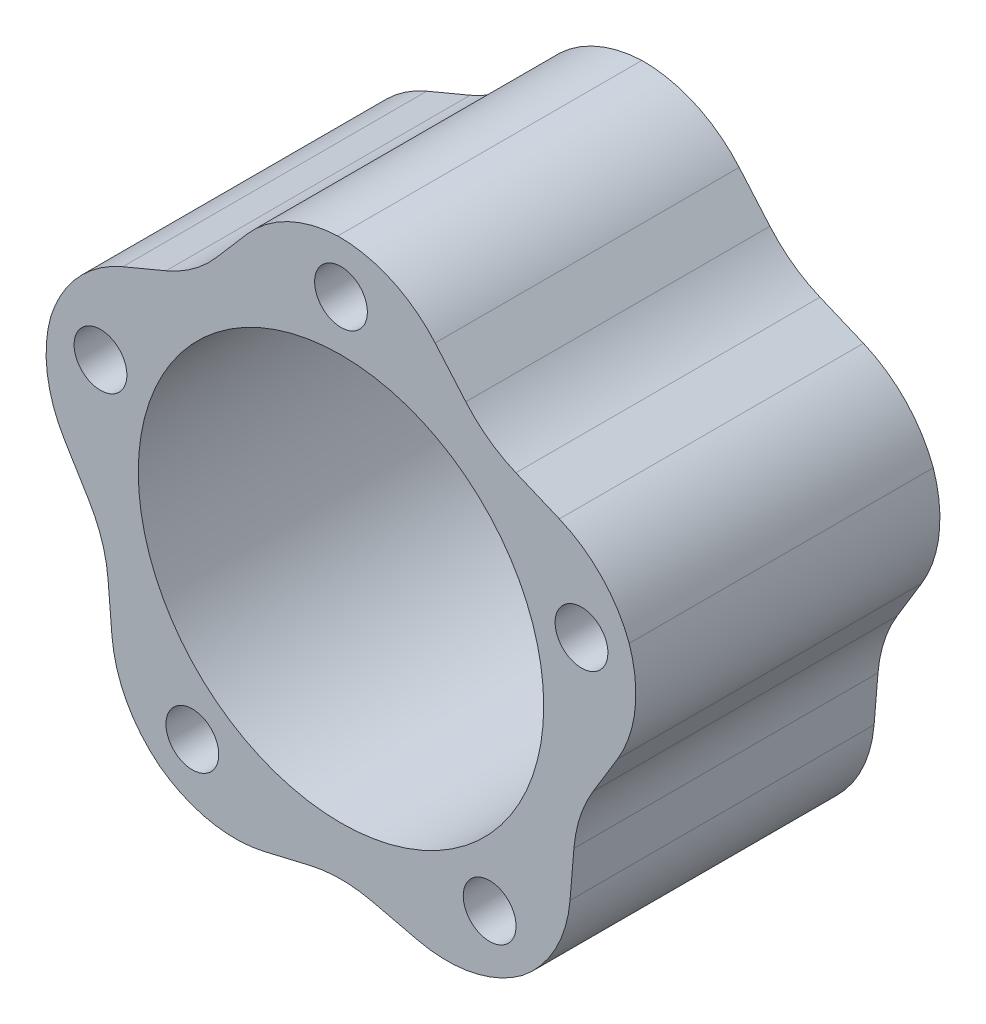
ISO-10303-21;
HEADER;
FILE_DESCRIPTION(('STEP AP214'),'2;1');
FILE_NAME('part.step','',(''),(''),'','','');
FILE_SCHEMA(('AUTOMOTIVE_DESIGN { 1 0 10303 214 1 1 1 1 }'));
ENDSEC;
DATA;
#1=APPLICATION_CONTEXT('core data for automotive mechanical design processes');
#2=APPLICATION_PROTOCOL_DEFINITION('international standard','automotive_design',2000,#1);
#3=PRODUCT_CONTEXT('',#1,'mechanical');
#4=PRODUCT('Part','Part','',(#3));
#5=PRODUCT_RELATED_PRODUCT_CATEGORY('part','',(#4));
#6=PRODUCT_DEFINITION_FORMATION('','',#4);
#7=PRODUCT_DEFINITION_CONTEXT('part definition',#1,'design');
#8=PRODUCT_DEFINITION('design','',#6,#7);
#9=PRODUCT_DEFINITION_SHAPE('','',#8);
#10=(LENGTH_UNIT() NAMED_UNIT(*) SI_UNIT(.MILLI.,.METRE.));
#11=(NAMED_UNIT(*) PLANE_ANGLE_UNIT() SI_UNIT($,.RADIAN.));
#12=(NAMED_UNIT(*) SI_UNIT($,.STERADIAN.) SOLID_ANGLE_UNIT());
#13=UNCERTAINTY_MEASURE_WITH_UNIT(LENGTH_MEASURE(1.E-05),#10,'distance_accuracy_value','');
#14=(GEOMETRIC_REPRESENTATION_CONTEXT(3) GLOBAL_UNCERTAINTY_ASSIGNED_CONTEXT((#13)) GLOBAL_UNIT_ASSIGNED_CONTEXT((#10,
#11,#12)) REPRESENTATION_CONTEXT('',''));
#15=CARTESIAN_POINT('',(0.,0.,0.));
#16=DIRECTION('',(0.,0.,1.));
#17=DIRECTION('',(1.,0.,0.));
#18=AXIS2_PLACEMENT_3D('',#15,#16,#17);
#19=CARTESIAN_POINT('',(0.,0.,28.575));
#20=DIRECTION('',(0.,0.,1.));
#21=DIRECTION('',(1.,0.,0.));
#22=AXIS2_PLACEMENT_3D('',#19,#20,#21);
#23=PLANE('',#22);
#24=DIRECTION('',(-0.0828522318108421,0.996561843381515,0.));
#25=VECTOR('',#24,1.);
#26=CARTESIAN_POINT('',(-44.2708771620068,-14.3844799594441,28.575));
#27=LINE('',#26,#25);
#28=CARTESIAN_POINT('',(-43.0416276018826,-29.1701191732451,28.575));
#29=VERTEX_POINT('',#28);
#30=CARTESIAN_POINT('',(-43.7754438644512,-20.3436425491958,28.575));
#31=VERTEX_POINT('',#30);
#32=EDGE_CURVE('E426',#29,#31,#27,.T.);
#33=ORIENTED_EDGE('',*,*,#32,.F.);
#34=CARTESIAN_POINT('',(-19.3109987063603,-27.1972004032494,28.575));
#35=DIRECTION('',(0.,0.,1.));
#36=DIRECTION('',(1.,0.,0.));
#37=AXIS2_PLACEMENT_3D('',#34,#35,#36);
#38=CIRCLE('',#37,23.8125);
#39=CARTESIAN_POINT('',(-34.0722514510411,-45.8825040844223,28.575));
#40=VERTEX_POINT('',#39);
#41=EDGE_CURVE('E363',#29,#40,#38,.T.);
#42=ORIENTED_EDGE('',*,*,#41,.T.);
#43=CARTESIAN_POINT('',(-19.8754800131073,-26.7647940492464,28.575));
#44=DIRECTION('',(0.,0.,1.));
#45=DIRECTION('',(1.,0.,0.));
#46=AXIS2_PLACEMENT_3D('',#43,#44,#45);
#47=CIRCLE('',#46,23.8125);
#48=CARTESIAN_POINT('',(-14.4186696495109,-49.9436287245648,28.575));
#49=VERTEX_POINT('',#48);
#50=EDGE_CURVE('E259',#40,#49,#47,.T.);
#51=ORIENTED_EDGE('',*,*,#50,.T.);
#52=DIRECTION('',(-0.97338938269054,-0.229157390597226,0.));
#53=VECTOR('',#52,1.);
#54=CARTESIAN_POINT('',(-88.8599387502561,-67.46875,28.575));
#55=LINE('',#54,#53);
#56=CARTESIAN_POINT('',(-5.82059772116957,-47.9194524161898,28.575));
#57=VERTEX_POINT('',#56);
#58=EDGE_CURVE('E470',#57,#49,#55,.T.);
#59=ORIENTED_EDGE('',*,*,#58,.F.);
#60=CARTESIAN_POINT('',(0.,-72.6435427365296,28.575));
#61=DIRECTION('',(0.,0.,1.));
#62=DIRECTION('',(1.,0.,0.));
#63=AXIS2_PLACEMENT_3D('',#60,#61,#62);
#64=CIRCLE('',#63,25.4);
#65=CARTESIAN_POINT('',(5.82059772116952,-47.9194524161898,28.575));
#66=VERTEX_POINT('',#65);
#67=EDGE_CURVE('E277',#57,#66,#64,.F.);
#68=ORIENTED_EDGE('',*,*,#67,.T.);
#69=DIRECTION('',(-0.97338938269054,0.229157390597226,0.));
#70=VECTOR('',#69,1.);
#71=CARTESIAN_POINT('',(0.,-46.549154969743,28.575));
#72=LINE('',#71,#70);
#73=CARTESIAN_POINT('',(14.4186696495108,-49.9436287245648,28.575));
#74=VERTEX_POINT('',#73);
#75=EDGE_CURVE('E480',#74,#66,#72,.T.);
#76=ORIENTED_EDGE('',*,*,#75,.F.);
#77=CARTESIAN_POINT('',(19.8754800131073,-26.7647940492464,28.575));
#78=DIRECTION('',(0.,0.,1.));
#79=DIRECTION('',(1.,0.,0.));
#80=AXIS2_PLACEMENT_3D('',#77,#78,#79);
#81=CIRCLE('',#80,23.8125);
#82=CARTESIAN_POINT('',(34.072251451041,-45.8825040844223,28.575));
#83=VERTEX_POINT('',#82);
#84=EDGE_CURVE('E263',#74,#83,#81,.T.);
#85=ORIENTED_EDGE('',*,*,#84,.T.);
#86=CARTESIAN_POINT('',(19.3109987063607,-27.1972004032491,28.575));
#87=DIRECTION('',(0.,0.,1.));
#88=DIRECTION('',(1.,0.,0.));
#89=AXIS2_PLACEMENT_3D('',#86,#87,#88);
#90=CIRCLE('',#89,23.8125);
#91=CARTESIAN_POINT('',(43.041627601883,-29.1701191732444,28.575));
#92=VERTEX_POINT('',#91);
#93=EDGE_CURVE('E244',#83,#92,#90,.T.);
#94=ORIENTED_EDGE('',*,*,#93,.T.);
#95=DIRECTION('',(-0.0828522318108279,-0.996561843381516,0.));
#96=VECTOR('',#95,1.);
#97=CARTESIAN_POINT('',(36.7073631408429,-105.359814125254,28.575));
#98=LINE('',#97,#96);
#99=CARTESIAN_POINT('',(43.7754438644515,-20.3436425491951,28.575));
#100=VERTEX_POINT('',#99);
#101=EDGE_CURVE('E457',#100,#92,#98,.T.);
#102=ORIENTED_EDGE('',*,*,#101,.F.);
#103=CARTESIAN_POINT('',(69.088114686342,-22.4480892371902,28.575));
#104=DIRECTION('',(0.,0.,1.));
#105=DIRECTION('',(1.,0.,0.));
#106=AXIS2_PLACEMENT_3D('',#103,#104,#105);
#107=CIRCLE('',#106,25.4);
#108=CARTESIAN_POINT('',(47.3727710909744,-9.27220776629314,28.575));
#109=VERTEX_POINT('',#108);
#110=EDGE_CURVE('E377',#100,#109,#107,.F.);
#111=ORIENTED_EDGE('',*,*,#110,.T.);
#112=DIRECTION('',(-0.518735490980199,-0.854934787219196,0.));
#113=VECTOR('',#112,1.);
#114=CARTESIAN_POINT('',(44.270877162007,-14.3844799594435,28.575));
#115=LINE('',#114,#113);
#116=CARTESIAN_POINT('',(51.9548275039003,-1.72046031016872,28.575));
#117=VERTEX_POINT('',#116);
#118=EDGE_CURVE('E466',#117,#109,#115,.T.);
#119=ORIENTED_EDGE('',*,*,#118,.F.);
#120=CARTESIAN_POINT('',(31.5966928832432,10.6319285687973,28.575));
#121=DIRECTION('',(0.,0.,1.));
#122=DIRECTION('',(1.,0.,0.));
#123=AXIS2_PLACEMENT_3D('',#120,#121,#122);
#124=CIRCLE('',#123,23.8125);
#125=CARTESIAN_POINT('',(54.1657592284169,18.2261632607953,28.575));
#126=VERTEX_POINT('',#125);
#127=EDGE_CURVE('E293',#117,#126,#124,.T.);
#128=ORIENTED_EDGE('',*,*,#127,.T.);
#129=CARTESIAN_POINT('',(31.8335014471133,9.96145403182651,28.575));
#130=DIRECTION('',(0.,0.,1.));
#131=DIRECTION('',(1.,0.,0.));
#132=AXIS2_PLACEMENT_3D('',#129,#130,#131);
#133=CIRCLE('',#132,23.8125);
#134=CARTESIAN_POINT('',(41.0430263153599,31.9209578502452,28.575));
#135=VERTEX_POINT('',#134);
#136=EDGE_CURVE('E313',#126,#135,#133,.T.);
#137=ORIENTED_EDGE('',*,*,#136,.T.);
#138=DIRECTION('',(0.922183887387664,-0.386751700503795,0.));
#139=VECTOR('',#138,1.);
#140=CARTESIAN_POINT('',(111.546336808682,2.35280382222236,28.575));
#141=LINE('',#140,#139);
#142=CARTESIAN_POINT('',(32.8753099020134,35.3463898658088,28.575));
#143=VERTEX_POINT('',#142);
#144=EDGE_CURVE('E442',#143,#135,#141,.T.);
#145=ORIENTED_EDGE('',*,*,#144,.F.);
#146=CARTESIAN_POINT('',(42.6988030948098,58.7698606054554,28.575));
#147=DIRECTION('',(0.,0.,1.));
#148=DIRECTION('',(1.,0.,0.));
#149=AXIS2_PLACEMENT_3D('',#146,#147,#148);
#150=CIRCLE('',#149,25.4);
#151=CARTESIAN_POINT('',(23.4573849543208,42.18891286587,28.575));
#152=VERTEX_POINT('',#151);
#153=EDGE_CURVE('E390',#143,#152,#150,.F.);
#154=ORIENTED_EDGE('',*,*,#153,.T.);
#155=DIRECTION('',(0.652793218093915,-0.757536147263344,0.));
#156=VECTOR('',#155,1.);
#157=CARTESIAN_POINT('',(27.3609067978916,37.6590574443152,28.575));
#158=LINE('',#157,#156);
#159=CARTESIAN_POINT('',(17.6911796275371,48.8803257765854,28.575));
#160=VERTEX_POINT('',#159);
#161=EDGE_CURVE('E453',#160,#152,#158,.T.);
#162=ORIENTED_EDGE('',*,*,#161,.F.);
#163=CARTESIAN_POINT('',(-0.347649879171224,33.335687270724,28.575));
#164=DIRECTION('',(0.,0.,1.));
#165=DIRECTION('',(1.,0.,0.));
#166=AXIS2_PLACEMENT_3D('',#163,#164,#165);
#167=CIRCLE('',#166,23.8125);
#168=CARTESIAN_POINT('',(-0.595971221436384,57.1468924640983,28.575));
#169=VERTEX_POINT('',#168);
#170=EDGE_CURVE('E317',#160,#169,#167,.T.);
#171=ORIENTED_EDGE('',*,*,#170,.T.);
#172=CARTESIAN_POINT('',(0.363187168874133,33.3537175722875,28.575));
#173=DIRECTION('',(0.,0.,1.));
#174=DIRECTION('',(1.,0.,0.));
#175=AXIS2_PLACEMENT_3D('',#172,#173,#174);
#176=CIRCLE('',#175,23.8125);
#177=CARTESIAN_POINT('',(-17.6756423378344,48.8983560781486,28.575));
#178=VERTEX_POINT('',#177);
#179=EDGE_CURVE('E338',#169,#178,#176,.T.);
#180=ORIENTED_EDGE('',*,*,#179,.T.);
#181=DIRECTION('',(0.652793218093904,0.757536147263353,0.));
#182=VECTOR('',#181,1.);
#183=CARTESIAN_POINT('',(32.2320643274654,106.813926856248,28.575));
#184=LINE('',#183,#182);
#185=CARTESIAN_POINT('',(-23.4573849543215,42.1889128658696,28.575));
#186=VERTEX_POINT('',#185);
#187=EDGE_CURVE('E443',#186,#178,#184,.T.);
#188=ORIENTED_EDGE('',*,*,#187,.F.);
#189=CARTESIAN_POINT('',(-42.6988030948106,58.7698606054548,28.575));
#190=DIRECTION('',(0.,0.,1.));
#191=DIRECTION('',(1.,0.,0.));
#192=AXIS2_PLACEMENT_3D('',#189,#190,#191);
#193=CIRCLE('',#192,25.4);
#194=CARTESIAN_POINT('',(-32.8753099020139,35.3463898658083,28.575));
#195=VERTEX_POINT('',#194);
#196=EDGE_CURVE('E403',#186,#195,#193,.F.);
#197=ORIENTED_EDGE('',*,*,#196,.T.);
#198=DIRECTION('',(0.922183887387658,0.386751700503808,0.));
#199=VECTOR('',#198,1.);
#200=CARTESIAN_POINT('',(-27.3609067978921,37.6590574443149,28.575));
#201=LINE('',#200,#199);
#202=CARTESIAN_POINT('',(-41.0210771930028,31.9301630212658,28.575));
#203=VERTEX_POINT('',#202);
#204=EDGE_CURVE('E438',#203,#195,#201,.T.);
#205=ORIENTED_EDGE('',*,*,#204,.F.);
#206=CARTESIAN_POINT('',(-31.8115523247558,9.97065920284721,28.575));
#207=DIRECTION('',(0.,0.,1.));
#208=DIRECTION('',(1.,0.,0.));
#209=AXIS2_PLACEMENT_3D('',#206,#207,#208);
#210=CIRCLE('',#209,23.8125);
#211=CARTESIAN_POINT('',(-54.5340896995814,17.0925586334524,28.575));
#212=VERTEX_POINT('',#211);
#213=EDGE_CURVE('E342',#203,#212,#210,.T.);
#214=ORIENTED_EDGE('',*,*,#213,.T.);
#215=CARTESIAN_POINT('',(-31.6090394324712,10.6522770790117,28.575));
#216=DIRECTION('',(0.,0.,1.));
#217=DIRECTION('',(1.,0.,0.));
#218=AXIS2_PLACEMENT_3D('',#215,#216,#217);
#219=CIRCLE('',#218,23.8125);
#220=CARTESIAN_POINT('',(-51.9671740531282,-1.70011179995462,28.575));
#221=VERTEX_POINT('',#220);
#222=EDGE_CURVE('E359',#212,#221,#219,.T.);
#223=ORIENTED_EDGE('',*,*,#222,.T.);
#224=DIRECTION('',(-0.518735490980211,0.854934787219188,0.));
#225=VECTOR('',#224,1.);
#226=CARTESIAN_POINT('',(-91.6258255267355,63.6618334467836,28.575));
#227=LINE('',#226,#225);
#228=CARTESIAN_POINT('',(-47.3727710909743,-9.27220776629378,28.575));
#229=VERTEX_POINT('',#228);
#230=EDGE_CURVE('E419',#229,#221,#227,.T.);
#231=ORIENTED_EDGE('',*,*,#230,.F.);
#232=CARTESIAN_POINT('',(-69.0881146863417,-22.4480892371912,28.575));
#233=DIRECTION('',(0.,0.,1.));
#234=DIRECTION('',(1.,0.,0.));
#235=AXIS2_PLACEMENT_3D('',#232,#233,#234);
#236=CIRCLE('',#235,25.4);
#237=EDGE_CURVE('E56',#229,#31,#236,.F.);
#238=ORIENTED_EDGE('',*,*,#237,.T.);
#239=EDGE_LOOP('',(#33,#42,#51,#59,#68,#76,#85,#94,#102,#111,#119,#128,#137,#145,#154,#162,#171,
#180,#188,#197,#205,#214,#223,#231,#238));
#240=FACE_BOUND('',#239,.T.);
#241=CARTESIAN_POINT('',(45.1974392465012,14.6855382304783,28.575));
#242=DIRECTION('',(0.,0.,1.));
#243=DIRECTION('',(0.309016994374945,-0.951056516295155,0.));
#244=AXIS2_PLACEMENT_3D('',#241,#242,#243);
#245=CIRCLE('',#244,4.96093749999999);
#246=CARTESIAN_POINT('',(46.7304532420331,9.96740629417026,28.575));
#247=VERTEX_POINT('',#246);
#248=EDGE_CURVE('E493',#247,#247,#245,.T.);
#249=ORIENTED_EDGE('',*,*,#248,.F.);
#250=EDGE_LOOP('',(#249));
#251=FACE_BOUND('',#250,.T.);
#252=CARTESIAN_POINT('',(27.9335536587959,-38.4472382304785,28.575));
#253=DIRECTION('',(0.,0.,1.));
#254=DIRECTION('',(-0.809016994374951,-0.587785252292469,0.));
#255=AXIS2_PLACEMENT_3D('',#252,#253,#254);
#256=CIRCLE('',#255,4.96093749999999);
#257=CARTESIAN_POINT('',(23.9200709132639,-41.3632041305232,28.575));
#258=VERTEX_POINT('',#257);
#259=EDGE_CURVE('E494',#258,#258,#256,.T.);
#260=ORIENTED_EDGE('',*,*,#259,.F.);
#261=EDGE_LOOP('',(#260));
#262=FACE_BOUND('',#261,.T.);
#263=CARTESIAN_POINT('',(-27.9335536587965,-38.4472382304781,28.575));
#264=DIRECTION('',(0.,0.,1.));
#265=DIRECTION('',(-0.809016994374942,0.58778525229248,0.));
#266=AXIS2_PLACEMENT_3D('',#263,#264,#265);
#267=CIRCLE('',#266,4.96093749999999);
#268=CARTESIAN_POINT('',(-31.9470364043284,-35.5312723304334,28.575));
#269=VERTEX_POINT('',#268);
#270=EDGE_CURVE('E503',#269,#269,#267,.T.);
#271=ORIENTED_EDGE('',*,*,#270,.F.);
#272=EDGE_LOOP('',(#271));
#273=FACE_BOUND('',#272,.T.);
#274=CARTESIAN_POINT('',(-45.1974392465009,14.6855382304789,28.575));
#275=DIRECTION('',(0.,0.,1.));
#276=DIRECTION('',(0.309016994374958,0.95105651629515,0.));
#277=AXIS2_PLACEMENT_3D('',#274,#275,#276);
#278=CIRCLE('',#277,4.96093749999999);
#279=CARTESIAN_POINT('',(-43.6644252509689,19.4036701667869,28.575));
#280=VERTEX_POINT('',#279);
#281=EDGE_CURVE('E511',#280,#280,#278,.T.);
#282=ORIENTED_EDGE('',*,*,#281,.F.);
#283=EDGE_LOOP('',(#282));
#284=FACE_BOUND('',#283,.T.);
#285=CARTESIAN_POINT('',(0.,47.5234,28.575));
#286=DIRECTION('',(0.,0.,1.));
#287=DIRECTION('',(1.,0.,0.));
#288=AXIS2_PLACEMENT_3D('',#285,#286,#287);
#289=CIRCLE('',#288,4.96093749999999);
#290=CARTESIAN_POINT('',(4.96093749999999,47.5234,28.575));
#291=VERTEX_POINT('',#290);
#292=EDGE_CURVE('E498',#291,#291,#289,.T.);
#293=ORIENTED_EDGE('',*,*,#292,.F.);
#294=EDGE_LOOP('',(#293));
#295=FACE_BOUND('',#294,.T.);
#296=CARTESIAN_POINT('',(0.,0.,28.575));
#297=DIRECTION('',(0.,0.,1.));
#298=DIRECTION('',(1.,0.,0.));
#299=AXIS2_PLACEMENT_3D('',#296,#297,#298);
#300=CIRCLE('',#299,38.1);
#301=CARTESIAN_POINT('',(38.1,0.,28.575));
#302=VERTEX_POINT('',#301);
#303=EDGE_CURVE('E253',#302,#302,#300,.T.);
#304=ORIENTED_EDGE('',*,*,#303,.F.);
#305=EDGE_LOOP('',(#304));
#306=FACE_BOUND('',#305,.T.);
#307=ADVANCED_FACE('F47',(#240,#251,#262,#273,#284,#295,#306),#23,.T.);
#308=CARTESIAN_POINT('',(0.,0.,-28.575));
#309=DIRECTION('',(0.,0.,1.));
#310=DIRECTION('',(1.,0.,0.));
#311=AXIS2_PLACEMENT_3D('',#308,#309,#310);
#312=PLANE('',#311);
#313=CARTESIAN_POINT('',(45.1974392465012,14.6855382304783,-28.575));
#314=DIRECTION('',(0.,0.,1.));
#315=DIRECTION('',(0.309016994374945,-0.951056516295155,0.));
#316=AXIS2_PLACEMENT_3D('',#313,#314,#315);
#317=CIRCLE('',#316,4.96093749999999);
#318=CARTESIAN_POINT('',(46.7304532420331,9.96740629417027,-28.575));
#319=VERTEX_POINT('',#318);
#320=EDGE_CURVE('E489',#319,#319,#317,.T.);
#321=ORIENTED_EDGE('',*,*,#320,.T.);
#322=EDGE_LOOP('',(#321));
#323=FACE_BOUND('',#322,.T.);
#324=CARTESIAN_POINT('',(27.9335536587959,-38.4472382304785,-28.575));
#325=DIRECTION('',(0.,0.,1.));
#326=DIRECTION('',(-0.809016994374951,-0.587785252292469,0.));
#327=AXIS2_PLACEMENT_3D('',#324,#325,#326);
#328=CIRCLE('',#327,4.96093749999999);
#329=CARTESIAN_POINT('',(23.9200709132639,-41.3632041305232,-28.575));
#330=VERTEX_POINT('',#329);
#331=EDGE_CURVE('E499',#330,#330,#328,.T.);
#332=ORIENTED_EDGE('',*,*,#331,.T.);
#333=EDGE_LOOP('',(#332));
#334=FACE_BOUND('',#333,.T.);
#335=CARTESIAN_POINT('',(-27.9335536587965,-38.4472382304781,-28.575));
#336=DIRECTION('',(0.,0.,1.));
#337=DIRECTION('',(-0.809016994374942,0.58778525229248,0.));
#338=AXIS2_PLACEMENT_3D('',#335,#336,#337);
#339=CIRCLE('',#338,4.96093749999999);
#340=CARTESIAN_POINT('',(-31.9470364043284,-35.5312723304334,-28.575));
#341=VERTEX_POINT('',#340);
#342=EDGE_CURVE('E507',#341,#341,#339,.T.);
#343=ORIENTED_EDGE('',*,*,#342,.T.);
#344=EDGE_LOOP('',(#343));
#345=FACE_BOUND('',#344,.T.);
#346=CARTESIAN_POINT('',(-45.1974392465009,14.6855382304789,-28.575));
#347=DIRECTION('',(0.,0.,1.));
#348=DIRECTION('',(0.309016994374958,0.95105651629515,0.));
#349=AXIS2_PLACEMENT_3D('',#346,#347,#348);
#350=CIRCLE('',#349,4.96093749999999);
#351=CARTESIAN_POINT('',(-43.6644252509689,19.4036701667868,-28.575));
#352=VERTEX_POINT('',#351);
#353=EDGE_CURVE('E483',#352,#352,#350,.T.);
#354=ORIENTED_EDGE('',*,*,#353,.T.);
#355=EDGE_LOOP('',(#354));
#356=FACE_BOUND('',#355,.T.);
#357=CARTESIAN_POINT('',(0.,47.5234,-28.575));
#358=DIRECTION('',(0.,0.,1.));
#359=DIRECTION('',(1.,0.,0.));
#360=AXIS2_PLACEMENT_3D('',#357,#358,#359);
#361=CIRCLE('',#360,4.96093749999999);
#362=CARTESIAN_POINT('',(4.96093749999999,47.5234,-28.575));
#363=VERTEX_POINT('',#362);
#364=EDGE_CURVE('E524',#363,#363,#361,.T.);
#365=ORIENTED_EDGE('',*,*,#364,.T.);
#366=EDGE_LOOP('',(#365));
#367=FACE_BOUND('',#366,.T.);
#368=CARTESIAN_POINT('',(-19.8754800131073,-26.7647940492464,-28.575));
#369=DIRECTION('',(0.,0.,1.));
#370=DIRECTION('',(1.,0.,0.));
#371=AXIS2_PLACEMENT_3D('',#368,#369,#370);
#372=CIRCLE('',#371,23.8125);
#373=CARTESIAN_POINT('',(-14.4186696495109,-49.9436287245648,-28.575));
#374=VERTEX_POINT('',#373);
#375=CARTESIAN_POINT('',(-34.0722514510411,-45.8825040844223,-28.575));
#376=VERTEX_POINT('',#375);
#377=EDGE_CURVE('E240',#374,#376,#372,.F.);
#378=ORIENTED_EDGE('',*,*,#377,.T.);
#379=CARTESIAN_POINT('',(-19.3109987063603,-27.1972004032494,-28.575));
#380=DIRECTION('',(0.,0.,1.));
#381=DIRECTION('',(1.,0.,0.));
#382=AXIS2_PLACEMENT_3D('',#379,#380,#381);
#383=CIRCLE('',#382,23.8125);
#384=CARTESIAN_POINT('',(-43.0416276018826,-29.1701191732451,-28.575));
#385=VERTEX_POINT('',#384);
#386=EDGE_CURVE('E353',#376,#385,#383,.F.);
#387=ORIENTED_EDGE('',*,*,#386,.T.);
#388=DIRECTION('',(-0.0828522318108421,0.996561843381515,0.));
#389=VECTOR('',#388,1.);
#390=CARTESIAN_POINT('',(-44.2708771620068,-14.3844799594441,-28.575));
#391=LINE('',#390,#389);
#392=CARTESIAN_POINT('',(-43.7754438644512,-20.3436425491958,-28.575));
#393=VERTEX_POINT('',#392);
#394=EDGE_CURVE('E431',#385,#393,#391,.T.);
#395=ORIENTED_EDGE('',*,*,#394,.T.);
#396=CARTESIAN_POINT('',(-69.0881146863417,-22.4480892371912,-28.575));
#397=DIRECTION('',(0.,0.,1.));
#398=DIRECTION('',(1.,0.,0.));
#399=AXIS2_PLACEMENT_3D('',#396,#397,#398);
#400=CIRCLE('',#399,25.4);
#401=CARTESIAN_POINT('',(-47.3727710909743,-9.27220776629378,-28.575));
#402=VERTEX_POINT('',#401);
#403=EDGE_CURVE('E11',#393,#402,#400,.T.);
#404=ORIENTED_EDGE('',*,*,#403,.T.);
#405=DIRECTION('',(-0.518735490980211,0.854934787219188,0.));
#406=VECTOR('',#405,1.);
#407=CARTESIAN_POINT('',(-91.6258255267355,63.6618334467836,-28.575));
#408=LINE('',#407,#406);
#409=CARTESIAN_POINT('',(-51.9671740531281,-1.70011179995463,-28.575));
#410=VERTEX_POINT('',#409);
#411=EDGE_CURVE('E420',#402,#410,#408,.T.);
#412=ORIENTED_EDGE('',*,*,#411,.T.);
#413=CARTESIAN_POINT('',(-31.6090394324712,10.6522770790117,-28.575));
#414=DIRECTION('',(0.,0.,1.));
#415=DIRECTION('',(1.,0.,0.));
#416=AXIS2_PLACEMENT_3D('',#413,#414,#415);
#417=CIRCLE('',#416,23.8125);
#418=CARTESIAN_POINT('',(-54.5340896995814,17.0925586334524,-28.575));
#419=VERTEX_POINT('',#418);
#420=EDGE_CURVE('E350',#410,#419,#417,.F.);
#421=ORIENTED_EDGE('',*,*,#420,.T.);
#422=CARTESIAN_POINT('',(-31.8115523247558,9.97065920284721,-28.575));
#423=DIRECTION('',(0.,0.,1.));
#424=DIRECTION('',(1.,0.,0.));
#425=AXIS2_PLACEMENT_3D('',#422,#423,#424);
#426=CIRCLE('',#425,23.8125);
#427=CARTESIAN_POINT('',(-41.0210771930028,31.9301630212658,-28.575));
#428=VERTEX_POINT('',#427);
#429=EDGE_CURVE('E332',#419,#428,#426,.F.);
#430=ORIENTED_EDGE('',*,*,#429,.T.);
#431=DIRECTION('',(0.922183887387658,0.386751700503808,0.));
#432=VECTOR('',#431,1.);
#433=CARTESIAN_POINT('',(-27.3609067978921,37.6590574443149,-28.575));
#434=LINE('',#433,#432);
#435=CARTESIAN_POINT('',(-32.8753099020139,35.3463898658083,-28.575));
#436=VERTEX_POINT('',#435);
#437=EDGE_CURVE('E437',#428,#436,#434,.T.);
#438=ORIENTED_EDGE('',*,*,#437,.T.);
#439=CARTESIAN_POINT('',(-42.6988030948106,58.7698606054548,-28.575));
#440=DIRECTION('',(0.,0.,1.));
#441=DIRECTION('',(1.,0.,0.));
#442=AXIS2_PLACEMENT_3D('',#439,#440,#441);
#443=CIRCLE('',#442,25.4);
#444=CARTESIAN_POINT('',(-23.4573849543215,42.1889128658696,-28.575));
#445=VERTEX_POINT('',#444);
#446=EDGE_CURVE('E406',#436,#445,#443,.T.);
#447=ORIENTED_EDGE('',*,*,#446,.T.);
#448=DIRECTION('',(0.652793218093904,0.757536147263353,0.));
#449=VECTOR('',#448,1.);
#450=CARTESIAN_POINT('',(32.2320643274654,106.813926856248,-28.575));
#451=LINE('',#450,#449);
#452=CARTESIAN_POINT('',(-17.6756423378345,48.8983560781486,-28.575));
#453=VERTEX_POINT('',#452);
#454=EDGE_CURVE('E434',#445,#453,#451,.T.);
#455=ORIENTED_EDGE('',*,*,#454,.T.);
#456=CARTESIAN_POINT('',(0.363187168874133,33.3537175722875,-28.575));
#457=DIRECTION('',(0.,0.,1.));
#458=DIRECTION('',(1.,0.,0.));
#459=AXIS2_PLACEMENT_3D('',#456,#457,#458);
#460=CIRCLE('',#459,23.8125);
#461=CARTESIAN_POINT('',(-0.595971221436384,57.1468924640983,-28.575));
#462=VERTEX_POINT('',#461);
#463=EDGE_CURVE('E329',#453,#462,#460,.F.);
#464=ORIENTED_EDGE('',*,*,#463,.T.);
#465=CARTESIAN_POINT('',(-0.347649879171224,33.335687270724,-28.575));
#466=DIRECTION('',(0.,0.,1.));
#467=DIRECTION('',(1.,0.,0.));
#468=AXIS2_PLACEMENT_3D('',#465,#466,#467);
#469=CIRCLE('',#468,23.8125);
#470=CARTESIAN_POINT('',(17.6911796275371,48.8803257765854,-28.575));
#471=VERTEX_POINT('',#470);
#472=EDGE_CURVE('E307',#462,#471,#469,.F.);
#473=ORIENTED_EDGE('',*,*,#472,.T.);
#474=DIRECTION('',(0.652793218093915,-0.757536147263344,0.));
#475=VECTOR('',#474,1.);
#476=CARTESIAN_POINT('',(27.3609067978916,37.6590574443152,-28.575));
#477=LINE('',#476,#475);
#478=CARTESIAN_POINT('',(23.4573849543208,42.18891286587,-28.575));
#479=VERTEX_POINT('',#478);
#480=EDGE_CURVE('E452',#471,#479,#477,.T.);
#481=ORIENTED_EDGE('',*,*,#480,.T.);
#482=CARTESIAN_POINT('',(42.6988030948098,58.7698606054554,-28.575));
#483=DIRECTION('',(0.,0.,1.));
#484=DIRECTION('',(1.,0.,0.));
#485=AXIS2_PLACEMENT_3D('',#482,#483,#484);
#486=CIRCLE('',#485,25.4);
#487=CARTESIAN_POINT('',(32.8753099020134,35.3463898658088,-28.575));
#488=VERTEX_POINT('',#487);
#489=EDGE_CURVE('E393',#479,#488,#486,.T.);
#490=ORIENTED_EDGE('',*,*,#489,.T.);
#491=DIRECTION('',(0.922183887387664,-0.386751700503795,0.));
#492=VECTOR('',#491,1.);
#493=CARTESIAN_POINT('',(111.546336808682,2.35280382222236,-28.575));
#494=LINE('',#493,#492);
#495=CARTESIAN_POINT('',(41.0430263153599,31.9209578502452,-28.575));
#496=VERTEX_POINT('',#495);
#497=EDGE_CURVE('E449',#488,#496,#494,.T.);
#498=ORIENTED_EDGE('',*,*,#497,.T.);
#499=CARTESIAN_POINT('',(31.8335014471133,9.96145403182651,-28.575));
#500=DIRECTION('',(0.,0.,1.));
#501=DIRECTION('',(1.,0.,0.));
#502=AXIS2_PLACEMENT_3D('',#499,#500,#501);
#503=CIRCLE('',#502,23.8125);
#504=CARTESIAN_POINT('',(54.1657592284169,18.2261632607953,-28.575));
#505=VERTEX_POINT('',#504);
#506=EDGE_CURVE('E304',#496,#505,#503,.F.);
#507=ORIENTED_EDGE('',*,*,#506,.T.);
#508=CARTESIAN_POINT('',(31.5966928832432,10.6319285687973,-28.575));
#509=DIRECTION('',(0.,0.,1.));
#510=DIRECTION('',(1.,0.,0.));
#511=AXIS2_PLACEMENT_3D('',#508,#509,#510);
#512=CIRCLE('',#511,23.8125);
#513=CARTESIAN_POINT('',(51.9548275039003,-1.72046031016872,-28.575));
#514=VERTEX_POINT('',#513);
#515=EDGE_CURVE('E229',#505,#514,#512,.F.);
#516=ORIENTED_EDGE('',*,*,#515,.T.);
#517=DIRECTION('',(-0.518735490980199,-0.854934787219196,0.));
#518=VECTOR('',#517,1.);
#519=CARTESIAN_POINT('',(44.270877162007,-14.3844799594435,-28.575));
#520=LINE('',#519,#518);
#521=CARTESIAN_POINT('',(47.3727710909744,-9.27220776629314,-28.575));
#522=VERTEX_POINT('',#521);
#523=EDGE_CURVE('E465',#514,#522,#520,.T.);
#524=ORIENTED_EDGE('',*,*,#523,.T.);
#525=CARTESIAN_POINT('',(69.088114686342,-22.4480892371902,-28.575));
#526=DIRECTION('',(0.,0.,1.));
#527=DIRECTION('',(1.,0.,0.));
#528=AXIS2_PLACEMENT_3D('',#525,#526,#527);
#529=CIRCLE('',#528,25.4);
#530=CARTESIAN_POINT('',(43.7754438644515,-20.3436425491951,-28.575));
#531=VERTEX_POINT('',#530);
#532=EDGE_CURVE('E380',#522,#531,#529,.T.);
#533=ORIENTED_EDGE('',*,*,#532,.T.);
#534=DIRECTION('',(-0.0828522318108279,-0.996561843381516,0.));
#535=VECTOR('',#534,1.);
#536=CARTESIAN_POINT('',(36.7073631408429,-105.359814125254,-28.575));
#537=LINE('',#536,#535);
#538=CARTESIAN_POINT('',(43.041627601883,-29.1701191732444,-28.575));
#539=VERTEX_POINT('',#538);
#540=EDGE_CURVE('E223',#531,#539,#537,.T.);
#541=ORIENTED_EDGE('',*,*,#540,.T.);
#542=CARTESIAN_POINT('',(19.3109987063607,-27.1972004032491,-28.575));
#543=DIRECTION('',(0.,0.,1.));
#544=DIRECTION('',(1.,0.,0.));
#545=AXIS2_PLACEMENT_3D('',#542,#543,#544);
#546=CIRCLE('',#545,23.8125);
#547=CARTESIAN_POINT('',(34.072251451041,-45.8825040844223,-28.575));
#548=VERTEX_POINT('',#547);
#549=EDGE_CURVE('E214',#539,#548,#546,.F.);
#550=ORIENTED_EDGE('',*,*,#549,.T.);
#551=CARTESIAN_POINT('',(19.8754800131073,-26.7647940492464,-28.575));
#552=DIRECTION('',(0.,0.,1.));
#553=DIRECTION('',(1.,0.,0.));
#554=AXIS2_PLACEMENT_3D('',#551,#552,#553);
#555=CIRCLE('',#554,23.8125);
#556=CARTESIAN_POINT('',(14.4186696495108,-49.9436287245648,-28.575));
#557=VERTEX_POINT('',#556);
#558=EDGE_CURVE('E220',#548,#557,#555,.F.);
#559=ORIENTED_EDGE('',*,*,#558,.T.);
#560=DIRECTION('',(-0.97338938269054,0.229157390597226,0.));
#561=VECTOR('',#560,1.);
#562=CARTESIAN_POINT('',(0.,-46.549154969743,-28.575));
#563=LINE('',#562,#561);
#564=CARTESIAN_POINT('',(5.82059772116952,-47.9194524161898,-28.575));
#565=VERTEX_POINT('',#564);
#566=EDGE_CURVE('E479',#557,#565,#563,.T.);
#567=ORIENTED_EDGE('',*,*,#566,.T.);
#568=CARTESIAN_POINT('',(0.,-72.6435427365296,-28.575));
#569=DIRECTION('',(0.,0.,1.));
#570=DIRECTION('',(1.,0.,0.));
#571=AXIS2_PLACEMENT_3D('',#568,#569,#570);
#572=CIRCLE('',#571,25.4);
#573=CARTESIAN_POINT('',(-5.82059772116957,-47.9194524161898,-28.575));
#574=VERTEX_POINT('',#573);
#575=EDGE_CURVE('E280',#565,#574,#572,.T.);
#576=ORIENTED_EDGE('',*,*,#575,.T.);
#577=DIRECTION('',(-0.97338938269054,-0.229157390597226,0.));
#578=VECTOR('',#577,1.);
#579=CARTESIAN_POINT('',(-88.8599387502561,-67.46875,-28.575));
#580=LINE('',#579,#578);
#581=EDGE_CURVE('E476',#574,#374,#580,.T.);
#582=ORIENTED_EDGE('',*,*,#581,.T.);
#583=EDGE_LOOP('',(#378,#387,#395,#404,#412,#421,#430,#438,#447,#455,#464,#473,#481,#490,#498,
#507,#516,#524,#533,#541,#550,#559,#567,#576,#582));
#584=FACE_BOUND('',#583,.T.);
#585=CARTESIAN_POINT('',(0.,0.,-28.575));
#586=DIRECTION('',(0.,0.,1.));
#587=DIRECTION('',(1.,0.,0.));
#588=AXIS2_PLACEMENT_3D('',#585,#586,#587);
#589=CIRCLE('',#588,38.1);
#590=CARTESIAN_POINT('',(38.1,0.,-28.575));
#591=VERTEX_POINT('',#590);
#592=EDGE_CURVE('E528',#591,#591,#589,.T.);
#593=ORIENTED_EDGE('',*,*,#592,.T.);
#594=EDGE_LOOP('',(#593));
#595=FACE_BOUND('',#594,.T.);
#596=ADVANCED_FACE('F217',(#323,#334,#345,#356,#367,#584,#595),#312,.F.);
#597=CARTESIAN_POINT('',(0.,0.,28.575));
#598=DIRECTION('',(0.,0.,-1.));
#599=DIRECTION('',(-1.,0.,0.));
#600=AXIS2_PLACEMENT_3D('',#597,#598,#599);
#601=CYLINDRICAL_SURFACE('',#600,38.1);
#602=ORIENTED_EDGE('',*,*,#303,.T.);
#603=EDGE_LOOP('',(#602));
#604=FACE_BOUND('',#603,.T.);
#605=ORIENTED_EDGE('',*,*,#592,.F.);
#606=EDGE_LOOP('',(#605));
#607=FACE_BOUND('',#606,.T.);
#608=ADVANCED_FACE('F535',(#604,#607),#601,.F.);
#609=CARTESIAN_POINT('',(0.,47.5234,28.575));
#610=DIRECTION('',(0.,0.,1.));
#611=DIRECTION('',(1.,0.,0.));
#612=AXIS2_PLACEMENT_3D('',#609,#610,#611);
#613=CYLINDRICAL_SURFACE('',#612,4.96093749999999);
#614=ORIENTED_EDGE('',*,*,#364,.F.);
#615=EDGE_LOOP('',(#614));
#616=FACE_BOUND('',#615,.T.);
#617=ORIENTED_EDGE('',*,*,#292,.T.);
#618=EDGE_LOOP('',(#617));
#619=FACE_BOUND('',#618,.T.);
#620=ADVANCED_FACE('F537',(#616,#619),#613,.F.);
#621=CARTESIAN_POINT('',(-45.1974392465009,14.6855382304789,28.575));
#622=DIRECTION('',(0.,0.,1.));
#623=DIRECTION('',(0.309016994374958,0.95105651629515,0.));
#624=AXIS2_PLACEMENT_3D('',#621,#622,#623);
#625=CYLINDRICAL_SURFACE('',#624,4.96093749999999);
#626=ORIENTED_EDGE('',*,*,#353,.F.);
#627=EDGE_LOOP('',(#626));
#628=FACE_BOUND('',#627,.T.);
#629=ORIENTED_EDGE('',*,*,#281,.T.);
#630=EDGE_LOOP('',(#629));
#631=FACE_BOUND('',#630,.T.);
#632=ADVANCED_FACE('F543',(#628,#631),#625,.F.);
#633=CARTESIAN_POINT('',(-27.9335536587965,-38.4472382304781,28.575));
#634=DIRECTION('',(0.,0.,1.));
#635=DIRECTION('',(-0.809016994374942,0.58778525229248,0.));
#636=AXIS2_PLACEMENT_3D('',#633,#634,#635);
#637=CYLINDRICAL_SURFACE('',#636,4.96093749999999);
#638=ORIENTED_EDGE('',*,*,#342,.F.);
#639=EDGE_LOOP('',(#638));
#640=FACE_BOUND('',#639,.T.);
#641=ORIENTED_EDGE('',*,*,#270,.T.);
#642=EDGE_LOOP('',(#641));
#643=FACE_BOUND('',#642,.T.);
#644=ADVANCED_FACE('F703',(#640,#643),#637,.F.);
#645=CARTESIAN_POINT('',(27.9335536587959,-38.4472382304785,28.575));
#646=DIRECTION('',(0.,0.,1.));
#647=DIRECTION('',(-0.809016994374951,-0.587785252292469,0.));
#648=AXIS2_PLACEMENT_3D('',#645,#646,#647);
#649=CYLINDRICAL_SURFACE('',#648,4.96093749999999);
#650=ORIENTED_EDGE('',*,*,#331,.F.);
#651=EDGE_LOOP('',(#650));
#652=FACE_BOUND('',#651,.T.);
#653=ORIENTED_EDGE('',*,*,#259,.T.);
#654=EDGE_LOOP('',(#653));
#655=FACE_BOUND('',#654,.T.);
#656=ADVANCED_FACE('F699',(#652,#655),#649,.F.);
#657=CARTESIAN_POINT('',(45.1974392465012,14.6855382304783,28.575));
#658=DIRECTION('',(0.,0.,1.));
#659=DIRECTION('',(0.309016994374945,-0.951056516295155,0.));
#660=AXIS2_PLACEMENT_3D('',#657,#658,#659);
#661=CYLINDRICAL_SURFACE('',#660,4.96093749999999);
#662=ORIENTED_EDGE('',*,*,#320,.F.);
#663=EDGE_LOOP('',(#662));
#664=FACE_BOUND('',#663,.T.);
#665=ORIENTED_EDGE('',*,*,#248,.T.);
#666=EDGE_LOOP('',(#665));
#667=FACE_BOUND('',#666,.T.);
#668=ADVANCED_FACE('F696',(#664,#667),#661,.F.);
#669=CARTESIAN_POINT('',(-88.8599387502561,-67.46875,-28.575));
#670=DIRECTION('',(-0.229157390597226,0.97338938269054,0.));
#671=DIRECTION('',(-0.97338938269054,-0.229157390597226,0.));
#672=AXIS2_PLACEMENT_3D('',#669,#670,#671);
#673=PLANE('',#672);
#674=ORIENTED_EDGE('',*,*,#581,.F.);
#675=DIRECTION('',(0.,0.,1.));
#676=VECTOR('',#675,1.);
#677=CARTESIAN_POINT('',(-5.82059772116955,-47.9194524161898,28.575));
#678=LINE('',#677,#676);
#679=EDGE_CURVE('E270',#574,#57,#678,.T.);
#680=ORIENTED_EDGE('',*,*,#679,.T.);
#681=ORIENTED_EDGE('',*,*,#58,.T.);
#682=DIRECTION('',(0.,0.,-1.));
#683=VECTOR('',#682,1.);
#684=CARTESIAN_POINT('',(-14.4186696495108,-49.9436287245648,-28.575));
#685=LINE('',#684,#683);
#686=EDGE_CURVE('E266',#49,#374,#685,.T.);
#687=ORIENTED_EDGE('',*,*,#686,.T.);
#688=EDGE_LOOP('',(#674,#680,#681,#687));
#689=FACE_BOUND('',#688,.T.);
#690=ADVANCED_FACE('F658',(#689),#673,.F.);
#691=CARTESIAN_POINT('',(0.,-46.549154969743,-28.575));
#692=DIRECTION('',(0.229157390597226,0.97338938269054,0.));
#693=DIRECTION('',(-0.97338938269054,0.229157390597226,0.));
#694=AXIS2_PLACEMENT_3D('',#691,#692,#693);
#695=PLANE('',#694);
#696=ORIENTED_EDGE('',*,*,#75,.T.);
#697=DIRECTION('',(0.,0.,1.));
#698=VECTOR('',#697,1.);
#699=CARTESIAN_POINT('',(5.82059772116952,-47.9194524161898,-28.575));
#700=LINE('',#699,#698);
#701=EDGE_CURVE('E274',#66,#565,#700,.F.);
#702=ORIENTED_EDGE('',*,*,#701,.T.);
#703=ORIENTED_EDGE('',*,*,#566,.F.);
#704=DIRECTION('',(0.,0.,-1.));
#705=VECTOR('',#704,1.);
#706=CARTESIAN_POINT('',(14.4186696495108,-49.9436287245648,-28.575));
#707=LINE('',#706,#705);
#708=EDGE_CURVE('E238',#557,#74,#707,.F.);
#709=ORIENTED_EDGE('',*,*,#708,.T.);
#710=EDGE_LOOP('',(#696,#702,#703,#709));
#711=FACE_BOUND('',#710,.T.);
#712=ADVANCED_FACE('F558',(#711),#695,.F.);
#713=CARTESIAN_POINT('',(19.8754800131073,-26.7647940492464,28.575));
#714=DIRECTION('',(0.,0.,-1.));
#715=DIRECTION('',(-1.,0.,0.));
#716=AXIS2_PLACEMENT_3D('',#713,#714,#715);
#717=CYLINDRICAL_SURFACE('',#716,23.8125);
#718=ORIENTED_EDGE('',*,*,#84,.F.);
#719=ORIENTED_EDGE('',*,*,#708,.F.);
#720=ORIENTED_EDGE('',*,*,#558,.F.);
#721=DIRECTION('',(0.,0.,-1.));
#722=VECTOR('',#721,1.);
#723=CARTESIAN_POINT('',(34.0722514510411,-45.8825040844223,28.575));
#724=LINE('',#723,#722);
#725=EDGE_CURVE('E237',#83,#548,#724,.T.);
#726=ORIENTED_EDGE('',*,*,#725,.F.);
#727=EDGE_LOOP('',(#718,#719,#720,#726));
#728=FACE_BOUND('',#727,.T.);
#729=ADVANCED_FACE('F236',(#728),#717,.T.);
#730=CARTESIAN_POINT('',(-19.8754800131073,-26.7647940492464,28.575));
#731=DIRECTION('',(0.,0.,-1.));
#732=DIRECTION('',(-1.,0.,0.));
#733=AXIS2_PLACEMENT_3D('',#730,#731,#732);
#734=CYLINDRICAL_SURFACE('',#733,23.8125);
#735=ORIENTED_EDGE('',*,*,#377,.F.);
#736=ORIENTED_EDGE('',*,*,#686,.F.);
#737=ORIENTED_EDGE('',*,*,#50,.F.);
#738=DIRECTION('',(0.,0.,-1.));
#739=VECTOR('',#738,1.);
#740=CARTESIAN_POINT('',(-34.0722514510411,-45.8825040844223,28.575));
#741=LINE('',#740,#739);
#742=EDGE_CURVE('E247',#376,#40,#741,.F.);
#743=ORIENTED_EDGE('',*,*,#742,.F.);
#744=EDGE_LOOP('',(#735,#736,#737,#743));
#745=FACE_BOUND('',#744,.T.);
#746=ADVANCED_FACE('F557',(#745),#734,.T.);
#747=CARTESIAN_POINT('',(0.,-72.6435427365296,-28.575));
#748=DIRECTION('',(0.,0.,-1.));
#749=DIRECTION('',(-1.,0.,0.));
#750=AXIS2_PLACEMENT_3D('',#747,#748,#749);
#751=CYLINDRICAL_SURFACE('',#750,25.4);
#752=ORIENTED_EDGE('',*,*,#575,.F.);
#753=ORIENTED_EDGE('',*,*,#701,.F.);
#754=ORIENTED_EDGE('',*,*,#67,.F.);
#755=ORIENTED_EDGE('',*,*,#679,.F.);
#756=EDGE_LOOP('',(#752,#753,#754,#755));
#757=FACE_BOUND('',#756,.T.);
#758=ADVANCED_FACE('F561',(#757),#751,.F.);
#759=CARTESIAN_POINT('',(-91.6258255267355,63.6618334467836,-28.575));
#760=DIRECTION('',(0.854934787219189,0.518735490980211,0.));
#761=DIRECTION('',(-0.518735490980211,0.854934787219189,0.));
#762=AXIS2_PLACEMENT_3D('',#759,#760,#761);
#763=PLANE('',#762);
#764=ORIENTED_EDGE('',*,*,#411,.F.);
#765=DIRECTION('',(0.,0.,1.));
#766=VECTOR('',#765,1.);
#767=CARTESIAN_POINT('',(-47.3727710909743,-9.27220776629379,28.575));
#768=LINE('',#767,#766);
#769=EDGE_CURVE('E409',#402,#229,#768,.T.);
#770=ORIENTED_EDGE('',*,*,#769,.T.);
#771=ORIENTED_EDGE('',*,*,#230,.T.);
#772=DIRECTION('',(0.,0.,-1.));
#773=VECTOR('',#772,1.);
#774=CARTESIAN_POINT('',(-51.9671740531282,-1.70011179995462,-28.575));
#775=LINE('',#774,#773);
#776=EDGE_CURVE('E366',#221,#410,#775,.T.);
#777=ORIENTED_EDGE('',*,*,#776,.T.);
#778=EDGE_LOOP('',(#764,#770,#771,#777));
#779=FACE_BOUND('',#778,.T.);
#780=ADVANCED_FACE('F418',(#779),#763,.F.);
#781=CARTESIAN_POINT('',(-44.2708771620068,-14.3844799594441,-28.575));
#782=DIRECTION('',(0.996561843381515,0.0828522318108421,0.));
#783=DIRECTION('',(-0.0828522318108421,0.996561843381515,0.));
#784=AXIS2_PLACEMENT_3D('',#781,#782,#783);
#785=PLANE('',#784);
#786=ORIENTED_EDGE('',*,*,#32,.T.);
#787=DIRECTION('',(0.,0.,1.));
#788=VECTOR('',#787,1.);
#789=CARTESIAN_POINT('',(-43.7754438644512,-20.3436425491958,-28.575));
#790=LINE('',#789,#788);
#791=EDGE_CURVE('E69',#31,#393,#790,.F.);
#792=ORIENTED_EDGE('',*,*,#791,.T.);
#793=ORIENTED_EDGE('',*,*,#394,.F.);
#794=DIRECTION('',(0.,0.,-1.));
#795=VECTOR('',#794,1.);
#796=CARTESIAN_POINT('',(-43.0416276018826,-29.1701191732451,-28.575));
#797=LINE('',#796,#795);
#798=EDGE_CURVE('E356',#385,#29,#797,.F.);
#799=ORIENTED_EDGE('',*,*,#798,.T.);
#800=EDGE_LOOP('',(#786,#792,#793,#799));
#801=FACE_BOUND('',#800,.T.);
#802=ADVANCED_FACE('F664',(#801),#785,.F.);
#803=CARTESIAN_POINT('',(32.2320643274654,106.813926856248,-28.575));
#804=DIRECTION('',(0.757536147263353,-0.652793218093904,0.));
#805=DIRECTION('',(0.652793218093904,0.757536147263353,0.));
#806=AXIS2_PLACEMENT_3D('',#803,#804,#805);
#807=PLANE('',#806);
#808=ORIENTED_EDGE('',*,*,#454,.F.);
#809=DIRECTION('',(0.,0.,1.));
#810=VECTOR('',#809,1.);
#811=CARTESIAN_POINT('',(-23.4573849543215,42.1889128658696,28.575));
#812=LINE('',#811,#810);
#813=EDGE_CURVE('E396',#445,#186,#812,.T.);
#814=ORIENTED_EDGE('',*,*,#813,.T.);
#815=ORIENTED_EDGE('',*,*,#187,.T.);
#816=DIRECTION('',(0.,0.,-1.));
#817=VECTOR('',#816,1.);
#818=CARTESIAN_POINT('',(-17.6756423378345,48.8983560781486,-28.575));
#819=LINE('',#818,#817);
#820=EDGE_CURVE('E346',#178,#453,#819,.T.);
#821=ORIENTED_EDGE('',*,*,#820,.T.);
#822=EDGE_LOOP('',(#808,#814,#815,#821));
#823=FACE_BOUND('',#822,.T.);
#824=ADVANCED_FACE('F616',(#823),#807,.F.);
#825=CARTESIAN_POINT('',(-27.3609067978921,37.6590574443149,-28.575));
#826=DIRECTION('',(0.386751700503808,-0.922183887387658,0.));
#827=DIRECTION('',(0.922183887387658,0.386751700503808,0.));
#828=AXIS2_PLACEMENT_3D('',#825,#826,#827);
#829=PLANE('',#828);
#830=ORIENTED_EDGE('',*,*,#204,.T.);
#831=DIRECTION('',(0.,0.,1.));
#832=VECTOR('',#831,1.);
#833=CARTESIAN_POINT('',(-32.8753099020139,35.3463898658083,-28.575));
#834=LINE('',#833,#832);
#835=EDGE_CURVE('E400',#195,#436,#834,.F.);
#836=ORIENTED_EDGE('',*,*,#835,.T.);
#837=ORIENTED_EDGE('',*,*,#437,.F.);
#838=DIRECTION('',(0.,0.,-1.));
#839=VECTOR('',#838,1.);
#840=CARTESIAN_POINT('',(-41.0210771930028,31.9301630212658,-28.575));
#841=LINE('',#840,#839);
#842=EDGE_CURVE('E335',#428,#203,#841,.F.);
#843=ORIENTED_EDGE('',*,*,#842,.T.);
#844=EDGE_LOOP('',(#830,#836,#837,#843));
#845=FACE_BOUND('',#844,.T.);
#846=ADVANCED_FACE('F674',(#845),#829,.F.);
#847=CARTESIAN_POINT('',(27.3609067978916,37.6590574443152,-28.575));
#848=DIRECTION('',(-0.757536147263344,-0.652793218093915,0.));
#849=DIRECTION('',(0.652793218093915,-0.757536147263343,0.));
#850=AXIS2_PLACEMENT_3D('',#847,#848,#849);
#851=PLANE('',#850);
#852=ORIENTED_EDGE('',*,*,#161,.T.);
#853=DIRECTION('',(0.,0.,1.));
#854=VECTOR('',#853,1.);
#855=CARTESIAN_POINT('',(23.4573849543208,42.18891286587,-28.575));
#856=LINE('',#855,#854);
#857=EDGE_CURVE('E387',#152,#479,#856,.F.);
#858=ORIENTED_EDGE('',*,*,#857,.T.);
#859=ORIENTED_EDGE('',*,*,#480,.F.);
#860=DIRECTION('',(0.,0.,-1.));
#861=VECTOR('',#860,1.);
#862=CARTESIAN_POINT('',(17.6911796275371,48.8803257765854,-28.575));
#863=LINE('',#862,#861);
#864=EDGE_CURVE('E310',#471,#160,#863,.F.);
#865=ORIENTED_EDGE('',*,*,#864,.T.);
#866=EDGE_LOOP('',(#852,#858,#859,#865));
#867=FACE_BOUND('',#866,.T.);
#868=ADVANCED_FACE('F627',(#867),#851,.F.);
#869=CARTESIAN_POINT('',(111.546336808682,2.35280382222236,-28.575));
#870=DIRECTION('',(-0.386751700503795,-0.922183887387663,0.));
#871=DIRECTION('',(0.922183887387664,-0.386751700503795,0.));
#872=AXIS2_PLACEMENT_3D('',#869,#870,#871);
#873=PLANE('',#872);
#874=ORIENTED_EDGE('',*,*,#497,.F.);
#875=DIRECTION('',(0.,0.,1.));
#876=VECTOR('',#875,1.);
#877=CARTESIAN_POINT('',(32.8753099020134,35.3463898658088,28.575));
#878=LINE('',#877,#876);
#879=EDGE_CURVE('E383',#488,#143,#878,.T.);
#880=ORIENTED_EDGE('',*,*,#879,.T.);
#881=ORIENTED_EDGE('',*,*,#144,.T.);
#882=DIRECTION('',(0.,0.,-1.));
#883=VECTOR('',#882,1.);
#884=CARTESIAN_POINT('',(41.0430263153599,31.9209578502452,-28.575));
#885=LINE('',#884,#883);
#886=EDGE_CURVE('E321',#135,#496,#885,.T.);
#887=ORIENTED_EDGE('',*,*,#886,.T.);
#888=EDGE_LOOP('',(#874,#880,#881,#887));
#889=FACE_BOUND('',#888,.T.);
#890=ADVANCED_FACE('F634',(#889),#873,.F.);
#891=CARTESIAN_POINT('',(36.7073631408429,-105.359814125254,-28.575));
#892=DIRECTION('',(-0.996561843381516,0.0828522318108279,0.));
#893=DIRECTION('',(-0.0828522318108279,-0.996561843381516,0.));
#894=AXIS2_PLACEMENT_3D('',#891,#892,#893);
#895=PLANE('',#894);
#896=ORIENTED_EDGE('',*,*,#540,.F.);
#897=DIRECTION('',(0.,0.,1.));
#898=VECTOR('',#897,1.);
#899=CARTESIAN_POINT('',(43.7754438644515,-20.3436425491952,28.575));
#900=LINE('',#899,#898);
#901=EDGE_CURVE('E370',#531,#100,#900,.T.);
#902=ORIENTED_EDGE('',*,*,#901,.T.);
#903=ORIENTED_EDGE('',*,*,#101,.T.);
#904=DIRECTION('',(0.,0.,-1.));
#905=VECTOR('',#904,1.);
#906=CARTESIAN_POINT('',(43.041627601883,-29.1701191732444,-28.575));
#907=LINE('',#906,#905);
#908=EDGE_CURVE('E297',#92,#539,#907,.T.);
#909=ORIENTED_EDGE('',*,*,#908,.T.);
#910=EDGE_LOOP('',(#896,#902,#903,#909));
#911=FACE_BOUND('',#910,.T.);
#912=ADVANCED_FACE('F649',(#911),#895,.F.);
#913=CARTESIAN_POINT('',(44.270877162007,-14.3844799594435,-28.575));
#914=DIRECTION('',(-0.854934787219196,0.518735490980199,0.));
#915=DIRECTION('',(-0.518735490980199,-0.854934787219196,0.));
#916=AXIS2_PLACEMENT_3D('',#913,#914,#915);
#917=PLANE('',#916);
#918=ORIENTED_EDGE('',*,*,#118,.T.);
#919=DIRECTION('',(0.,0.,1.));
#920=VECTOR('',#919,1.);
#921=CARTESIAN_POINT('',(47.3727710909744,-9.27220776629314,-28.575));
#922=LINE('',#921,#920);
#923=EDGE_CURVE('E374',#109,#522,#922,.F.);
#924=ORIENTED_EDGE('',*,*,#923,.T.);
#925=ORIENTED_EDGE('',*,*,#523,.F.);
#926=DIRECTION('',(0.,0.,-1.));
#927=VECTOR('',#926,1.);
#928=CARTESIAN_POINT('',(51.9548275039003,-1.72046031016873,-28.575));
#929=LINE('',#928,#927);
#930=EDGE_CURVE('E288',#514,#117,#929,.F.);
#931=ORIENTED_EDGE('',*,*,#930,.T.);
#932=EDGE_LOOP('',(#918,#924,#925,#931));
#933=FACE_BOUND('',#932,.T.);
#934=ADVANCED_FACE('F568',(#933),#917,.F.);
#935=CARTESIAN_POINT('',(31.5966928832432,10.6319285687973,28.575));
#936=DIRECTION('',(0.,0.,-1.));
#937=DIRECTION('',(-1.,0.,0.));
#938=AXIS2_PLACEMENT_3D('',#935,#936,#937);
#939=CYLINDRICAL_SURFACE('',#938,23.8125);
#940=ORIENTED_EDGE('',*,*,#127,.F.);
#941=ORIENTED_EDGE('',*,*,#930,.F.);
#942=ORIENTED_EDGE('',*,*,#515,.F.);
#943=DIRECTION('',(0.,0.,-1.));
#944=VECTOR('',#943,1.);
#945=CARTESIAN_POINT('',(54.165759228417,18.2261632607953,28.575));
#946=LINE('',#945,#944);
#947=EDGE_CURVE('E230',#126,#505,#946,.T.);
#948=ORIENTED_EDGE('',*,*,#947,.F.);
#949=EDGE_LOOP('',(#940,#941,#942,#948));
#950=FACE_BOUND('',#949,.T.);
#951=ADVANCED_FACE('F565',(#950),#939,.T.);
#952=CARTESIAN_POINT('',(19.3109987063607,-27.1972004032491,28.575));
#953=DIRECTION('',(0.,0.,-1.));
#954=DIRECTION('',(-1.,0.,0.));
#955=AXIS2_PLACEMENT_3D('',#952,#953,#954);
#956=CYLINDRICAL_SURFACE('',#955,23.8125);
#957=ORIENTED_EDGE('',*,*,#549,.F.);
#958=ORIENTED_EDGE('',*,*,#908,.F.);
#959=ORIENTED_EDGE('',*,*,#93,.F.);
#960=ORIENTED_EDGE('',*,*,#725,.T.);
#961=EDGE_LOOP('',(#957,#958,#959,#960));
#962=FACE_BOUND('',#961,.T.);
#963=ADVANCED_FACE('F242',(#962),#956,.T.);
#964=CARTESIAN_POINT('',(-0.347649879171224,33.335687270724,28.575));
#965=DIRECTION('',(0.,0.,-1.));
#966=DIRECTION('',(-1.,0.,0.));
#967=AXIS2_PLACEMENT_3D('',#964,#965,#966);
#968=CYLINDRICAL_SURFACE('',#967,23.8125);
#969=ORIENTED_EDGE('',*,*,#170,.F.);
#970=ORIENTED_EDGE('',*,*,#864,.F.);
#971=ORIENTED_EDGE('',*,*,#472,.F.);
#972=DIRECTION('',(0.,0.,-1.));
#973=VECTOR('',#972,1.);
#974=CARTESIAN_POINT('',(-0.595971221436384,57.1468924640984,28.575));
#975=LINE('',#974,#973);
#976=EDGE_CURVE('E300',#169,#462,#975,.T.);
#977=ORIENTED_EDGE('',*,*,#976,.F.);
#978=EDGE_LOOP('',(#969,#970,#971,#977));
#979=FACE_BOUND('',#978,.T.);
#980=ADVANCED_FACE('F572',(#979),#968,.T.);
#981=CARTESIAN_POINT('',(31.8335014471133,9.96145403182651,28.575));
#982=DIRECTION('',(0.,0.,-1.));
#983=DIRECTION('',(-1.,0.,0.));
#984=AXIS2_PLACEMENT_3D('',#981,#982,#983);
#985=CYLINDRICAL_SURFACE('',#984,23.8125);
#986=ORIENTED_EDGE('',*,*,#506,.F.);
#987=ORIENTED_EDGE('',*,*,#886,.F.);
#988=ORIENTED_EDGE('',*,*,#136,.F.);
#989=ORIENTED_EDGE('',*,*,#947,.T.);
#990=EDGE_LOOP('',(#986,#987,#988,#989));
#991=FACE_BOUND('',#990,.T.);
#992=ADVANCED_FACE('F575',(#991),#985,.T.);
#993=CARTESIAN_POINT('',(-31.8115523247558,9.97065920284721,28.575));
#994=DIRECTION('',(0.,0.,-1.));
#995=DIRECTION('',(-1.,0.,0.));
#996=AXIS2_PLACEMENT_3D('',#993,#994,#995);
#997=CYLINDRICAL_SURFACE('',#996,23.8125);
#998=ORIENTED_EDGE('',*,*,#213,.F.);
#999=ORIENTED_EDGE('',*,*,#842,.F.);
#1000=ORIENTED_EDGE('',*,*,#429,.F.);
#1001=DIRECTION('',(0.,0.,-1.));
#1002=VECTOR('',#1001,1.);
#1003=CARTESIAN_POINT('',(-54.5340896995814,17.0925586334524,28.575));
#1004=LINE('',#1003,#1002);
#1005=EDGE_CURVE('E325',#212,#419,#1004,.T.);
#1006=ORIENTED_EDGE('',*,*,#1005,.F.);
#1007=EDGE_LOOP('',(#998,#999,#1000,#1006));
#1008=FACE_BOUND('',#1007,.T.);
#1009=ADVANCED_FACE('F579',(#1008),#997,.T.);
#1010=CARTESIAN_POINT('',(0.363187168874133,33.3537175722875,28.575));
#1011=DIRECTION('',(0.,0.,-1.));
#1012=DIRECTION('',(-1.,0.,0.));
#1013=AXIS2_PLACEMENT_3D('',#1010,#1011,#1012);
#1014=CYLINDRICAL_SURFACE('',#1013,23.8125);
#1015=ORIENTED_EDGE('',*,*,#463,.F.);
#1016=ORIENTED_EDGE('',*,*,#820,.F.);
#1017=ORIENTED_EDGE('',*,*,#179,.F.);
#1018=ORIENTED_EDGE('',*,*,#976,.T.);
#1019=EDGE_LOOP('',(#1015,#1016,#1017,#1018));
#1020=FACE_BOUND('',#1019,.T.);
#1021=ADVANCED_FACE('F583',(#1020),#1014,.T.);
#1022=CARTESIAN_POINT('',(-19.3109987063603,-27.1972004032494,28.575));
#1023=DIRECTION('',(0.,0.,-1.));
#1024=DIRECTION('',(-1.,0.,0.));
#1025=AXIS2_PLACEMENT_3D('',#1022,#1023,#1024);
#1026=CYLINDRICAL_SURFACE('',#1025,23.8125);
#1027=ORIENTED_EDGE('',*,*,#41,.F.);
#1028=ORIENTED_EDGE('',*,*,#798,.F.);
#1029=ORIENTED_EDGE('',*,*,#386,.F.);
#1030=ORIENTED_EDGE('',*,*,#742,.T.);
#1031=EDGE_LOOP('',(#1027,#1028,#1029,#1030));
#1032=FACE_BOUND('',#1031,.T.);
#1033=ADVANCED_FACE('F587',(#1032),#1026,.T.);
#1034=CARTESIAN_POINT('',(-31.6090394324712,10.6522770790117,28.575));
#1035=DIRECTION('',(0.,0.,-1.));
#1036=DIRECTION('',(-1.,0.,0.));
#1037=AXIS2_PLACEMENT_3D('',#1034,#1035,#1036);
#1038=CYLINDRICAL_SURFACE('',#1037,23.8125);
#1039=ORIENTED_EDGE('',*,*,#420,.F.);
#1040=ORIENTED_EDGE('',*,*,#776,.F.);
#1041=ORIENTED_EDGE('',*,*,#222,.F.);
#1042=ORIENTED_EDGE('',*,*,#1005,.T.);
#1043=EDGE_LOOP('',(#1039,#1040,#1041,#1042));
#1044=FACE_BOUND('',#1043,.T.);
#1045=ADVANCED_FACE('F591',(#1044),#1038,.T.);
#1046=CARTESIAN_POINT('',(69.088114686342,-22.4480892371902,-28.575));
#1047=DIRECTION('',(0.,0.,-1.));
#1048=DIRECTION('',(-1.,0.,0.));
#1049=AXIS2_PLACEMENT_3D('',#1046,#1047,#1048);
#1050=CYLINDRICAL_SURFACE('',#1049,25.4);
#1051=ORIENTED_EDGE('',*,*,#532,.F.);
#1052=ORIENTED_EDGE('',*,*,#923,.F.);
#1053=ORIENTED_EDGE('',*,*,#110,.F.);
#1054=ORIENTED_EDGE('',*,*,#901,.F.);
#1055=EDGE_LOOP('',(#1051,#1052,#1053,#1054));
#1056=FACE_BOUND('',#1055,.T.);
#1057=ADVANCED_FACE('F595',(#1056),#1050,.F.);
#1058=CARTESIAN_POINT('',(42.6988030948098,58.7698606054554,-28.575));
#1059=DIRECTION('',(0.,0.,-1.));
#1060=DIRECTION('',(-1.,0.,0.));
#1061=AXIS2_PLACEMENT_3D('',#1058,#1059,#1060);
#1062=CYLINDRICAL_SURFACE('',#1061,25.4);
#1063=ORIENTED_EDGE('',*,*,#489,.F.);
#1064=ORIENTED_EDGE('',*,*,#857,.F.);
#1065=ORIENTED_EDGE('',*,*,#153,.F.);
#1066=ORIENTED_EDGE('',*,*,#879,.F.);
#1067=EDGE_LOOP('',(#1063,#1064,#1065,#1066));
#1068=FACE_BOUND('',#1067,.T.);
#1069=ADVANCED_FACE('F599',(#1068),#1062,.F.);
#1070=CARTESIAN_POINT('',(-42.6988030948106,58.7698606054548,-28.575));
#1071=DIRECTION('',(0.,0.,-1.));
#1072=DIRECTION('',(-1.,0.,0.));
#1073=AXIS2_PLACEMENT_3D('',#1070,#1071,#1072);
#1074=CYLINDRICAL_SURFACE('',#1073,25.4);
#1075=ORIENTED_EDGE('',*,*,#446,.F.);
#1076=ORIENTED_EDGE('',*,*,#835,.F.);
#1077=ORIENTED_EDGE('',*,*,#196,.F.);
#1078=ORIENTED_EDGE('',*,*,#813,.F.);
#1079=EDGE_LOOP('',(#1075,#1076,#1077,#1078));
#1080=FACE_BOUND('',#1079,.T.);
#1081=ADVANCED_FACE('F602',(#1080),#1074,.F.);
#1082=CARTESIAN_POINT('',(-69.0881146863417,-22.4480892371912,-28.575));
#1083=DIRECTION('',(0.,0.,-1.));
#1084=DIRECTION('',(-1.,0.,0.));
#1085=AXIS2_PLACEMENT_3D('',#1082,#1083,#1084);
#1086=CYLINDRICAL_SURFACE('',#1085,25.4);
#1087=ORIENTED_EDGE('',*,*,#403,.F.);
#1088=ORIENTED_EDGE('',*,*,#791,.F.);
#1089=ORIENTED_EDGE('',*,*,#237,.F.);
#1090=ORIENTED_EDGE('',*,*,#769,.F.);
#1091=EDGE_LOOP('',(#1087,#1088,#1089,#1090));
#1092=FACE_BOUND('',#1091,.T.);
#1093=ADVANCED_FACE('F49',(#1092),#1086,.F.);
#1094=CLOSED_SHELL('',(#307,#596,#608,#620,#632,#644,#656,#668,#690,#712,#729,#746,#758,#780,
#802,#824,#846,#868,#890,#912,#934,#951,#963,#980,#992,#1009,#1021,#1033,#1045,#1057,#1069,
#1081,#1093));
#1095=MANIFOLD_SOLID_BREP('B2',#1094);
#1096=ADVANCED_BREP_SHAPE_REPRESENTATION('',(#18,#1095),#14);
#1097=SHAPE_DEFINITION_REPRESENTATION(#9,#1096);
ENDSEC;
END-ISO-10303-21;
